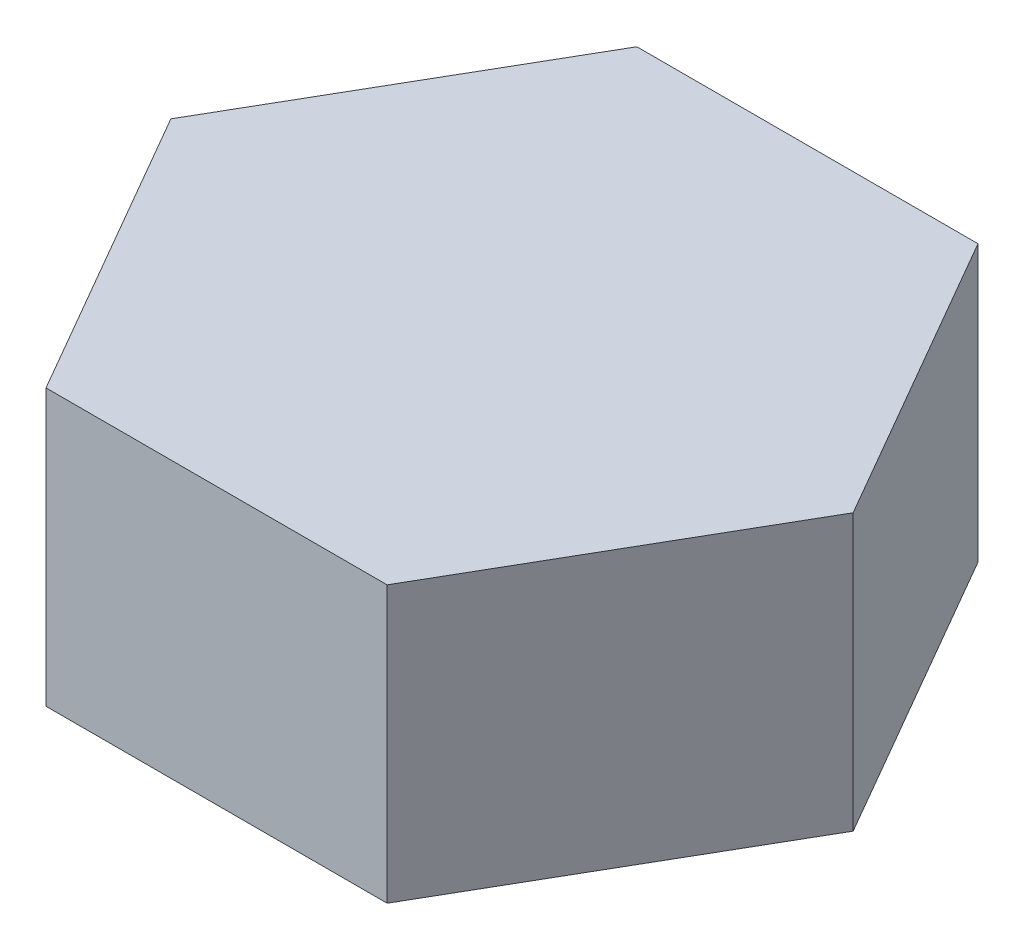
ISO-10303-21;
HEADER;
FILE_DESCRIPTION(('STEP AP214'),'2;1');
FILE_NAME('part.step','',(''),(''),'','','');
FILE_SCHEMA(('AUTOMOTIVE_DESIGN { 1 0 10303 214 1 1 1 1 }'));
ENDSEC;
DATA;
#1=APPLICATION_CONTEXT('core data for automotive mechanical design processes');
#2=APPLICATION_PROTOCOL_DEFINITION('international standard','automotive_design',2000,#1);
#3=PRODUCT_CONTEXT('',#1,'mechanical');
#4=PRODUCT('Part','Part','',(#3));
#5=PRODUCT_RELATED_PRODUCT_CATEGORY('part','',(#4));
#6=PRODUCT_DEFINITION_FORMATION('','',#4);
#7=PRODUCT_DEFINITION_CONTEXT('part definition',#1,'design');
#8=PRODUCT_DEFINITION('design','',#6,#7);
#9=PRODUCT_DEFINITION_SHAPE('','',#8);
#10=(LENGTH_UNIT() NAMED_UNIT(*) SI_UNIT(.MILLI.,.METRE.));
#11=(NAMED_UNIT(*) PLANE_ANGLE_UNIT() SI_UNIT($,.RADIAN.));
#12=(NAMED_UNIT(*) SI_UNIT($,.STERADIAN.) SOLID_ANGLE_UNIT());
#13=UNCERTAINTY_MEASURE_WITH_UNIT(LENGTH_MEASURE(1.E-05),#10,'distance_accuracy_value','');
#14=(GEOMETRIC_REPRESENTATION_CONTEXT(3) GLOBAL_UNCERTAINTY_ASSIGNED_CONTEXT((#13)) GLOBAL_UNIT_ASSIGNED_CONTEXT((#10,
#11,#12)) REPRESENTATION_CONTEXT('',''));
#15=CARTESIAN_POINT('',(0.,0.,0.));
#16=DIRECTION('',(0.,0.,1.));
#17=DIRECTION('',(1.,0.,0.));
#18=AXIS2_PLACEMENT_3D('',#15,#16,#17);
#19=CARTESIAN_POINT('',(1.299038105,2.1,2.24999999882799));
#20=DIRECTION('',(-0.866025403784439,0.,-0.5));
#21=DIRECTION('',(-0.5,0.,0.866025403784439));
#22=AXIS2_PLACEMENT_3D('',#19,#20,#21);
#23=PLANE('',#22);
#24=DIRECTION('',(0.5,0.,-0.866025403784439));
#25=VECTOR('',#24,1.);
#26=CARTESIAN_POINT('',(1.299038105,0.,2.24999999882799));
#27=LINE('',#26,#25);
#28=CARTESIAN_POINT('',(1.299038105,0.,2.24999999882799));
#29=VERTEX_POINT('',#28);
#30=CARTESIAN_POINT('',(2.59807621,0.,0.));
#31=VERTEX_POINT('',#30);
#32=EDGE_CURVE('E122',#29,#31,#27,.T.);
#33=ORIENTED_EDGE('',*,*,#32,.T.);
#34=DIRECTION('',(0.,-1.,0.));
#35=VECTOR('',#34,1.);
#36=CARTESIAN_POINT('',(2.59807621,2.1,0.));
#37=LINE('',#36,#35);
#38=CARTESIAN_POINT('',(2.59807621,2.1,0.));
#39=VERTEX_POINT('',#38);
#40=EDGE_CURVE('E11',#39,#31,#37,.T.);
#41=ORIENTED_EDGE('',*,*,#40,.F.);
#42=DIRECTION('',(0.5,0.,-0.866025403784439));
#43=VECTOR('',#42,1.);
#44=CARTESIAN_POINT('',(1.299038105,2.1,2.24999999882799));
#45=LINE('',#44,#43);
#46=CARTESIAN_POINT('',(1.299038105,2.1,2.24999999882799));
#47=VERTEX_POINT('',#46);
#48=EDGE_CURVE('E132',#47,#39,#45,.T.);
#49=ORIENTED_EDGE('',*,*,#48,.F.);
#50=DIRECTION('',(0.,-1.,0.));
#51=VECTOR('',#50,1.);
#52=CARTESIAN_POINT('',(1.299038105,2.1,2.24999999882799));
#53=LINE('',#52,#51);
#54=EDGE_CURVE('E118',#47,#29,#53,.T.);
#55=ORIENTED_EDGE('',*,*,#54,.T.);
#56=EDGE_LOOP('',(#33,#41,#49,#55));
#57=FACE_BOUND('',#56,.T.);
#58=ADVANCED_FACE('F38',(#57),#23,.F.);
#59=CARTESIAN_POINT('',(2.59807621,2.1,0.));
#60=DIRECTION('',(-0.866025403784439,0.,0.5));
#61=DIRECTION('',(0.5,0.,0.866025403784439));
#62=AXIS2_PLACEMENT_3D('',#59,#60,#61);
#63=PLANE('',#62);
#64=DIRECTION('',(-0.5,0.,-0.866025403784438));
#65=VECTOR('',#64,1.);
#66=CARTESIAN_POINT('',(2.59807621,0.,0.));
#67=LINE('',#66,#65);
#68=CARTESIAN_POINT('',(1.299038105,0.,-2.24999999882799));
#69=VERTEX_POINT('',#68);
#70=EDGE_CURVE('E125',#31,#69,#67,.T.);
#71=ORIENTED_EDGE('',*,*,#70,.T.);
#72=DIRECTION('',(0.,-1.,0.));
#73=VECTOR('',#72,1.);
#74=CARTESIAN_POINT('',(1.299038105,2.1,-2.24999999882799));
#75=LINE('',#74,#73);
#76=CARTESIAN_POINT('',(1.299038105,2.1,-2.24999999882799));
#77=VERTEX_POINT('',#76);
#78=EDGE_CURVE('E46',#77,#69,#75,.T.);
#79=ORIENTED_EDGE('',*,*,#78,.F.);
#80=DIRECTION('',(-0.5,0.,-0.866025403784438));
#81=VECTOR('',#80,1.);
#82=CARTESIAN_POINT('',(2.59807621,2.1,0.));
#83=LINE('',#82,#81);
#84=EDGE_CURVE('E91',#39,#77,#83,.T.);
#85=ORIENTED_EDGE('',*,*,#84,.F.);
#86=ORIENTED_EDGE('',*,*,#40,.T.);
#87=EDGE_LOOP('',(#71,#79,#85,#86));
#88=FACE_BOUND('',#87,.T.);
#89=ADVANCED_FACE('F156',(#88),#63,.F.);
#90=CARTESIAN_POINT('',(1.299038105,2.1,-2.24999999882799));
#91=DIRECTION('',(0.,0.,1.));
#92=DIRECTION('',(1.,0.,0.));
#93=AXIS2_PLACEMENT_3D('',#90,#91,#92);
#94=PLANE('',#93);
#95=DIRECTION('',(-1.,0.,0.));
#96=VECTOR('',#95,1.);
#97=CARTESIAN_POINT('',(1.299038105,0.,-2.24999999882799));
#98=LINE('',#97,#96);
#99=CARTESIAN_POINT('',(-1.299038105,0.,-2.24999999882799));
#100=VERTEX_POINT('',#99);
#101=EDGE_CURVE('E127',#69,#100,#98,.T.);
#102=ORIENTED_EDGE('',*,*,#101,.T.);
#103=DIRECTION('',(0.,-1.,0.));
#104=VECTOR('',#103,1.);
#105=CARTESIAN_POINT('',(-1.299038105,2.1,-2.24999999882799));
#106=LINE('',#105,#104);
#107=CARTESIAN_POINT('',(-1.299038105,2.1,-2.24999999882799));
#108=VERTEX_POINT('',#107);
#109=EDGE_CURVE('E113',#108,#100,#106,.T.);
#110=ORIENTED_EDGE('',*,*,#109,.F.);
#111=DIRECTION('',(-1.,0.,0.));
#112=VECTOR('',#111,1.);
#113=CARTESIAN_POINT('',(1.299038105,2.1,-2.24999999882799));
#114=LINE('',#113,#112);
#115=EDGE_CURVE('E104',#77,#108,#114,.T.);
#116=ORIENTED_EDGE('',*,*,#115,.F.);
#117=ORIENTED_EDGE('',*,*,#78,.T.);
#118=EDGE_LOOP('',(#102,#110,#116,#117));
#119=FACE_BOUND('',#118,.T.);
#120=ADVANCED_FACE('F138',(#119),#94,.F.);
#121=CARTESIAN_POINT('',(-1.299038105,2.1,-2.24999999882799));
#122=DIRECTION('',(0.866025403784439,0.,0.5));
#123=DIRECTION('',(0.5,0.,-0.866025403784439));
#124=AXIS2_PLACEMENT_3D('',#121,#122,#123);
#125=PLANE('',#124);
#126=DIRECTION('',(-0.5,0.,0.866025403784439));
#127=VECTOR('',#126,1.);
#128=CARTESIAN_POINT('',(-1.299038105,0.,-2.24999999882799));
#129=LINE('',#128,#127);
#130=CARTESIAN_POINT('',(-2.59807621,0.,0.));
#131=VERTEX_POINT('',#130);
#132=EDGE_CURVE('E112',#100,#131,#129,.T.);
#133=ORIENTED_EDGE('',*,*,#132,.T.);
#134=DIRECTION('',(0.,-1.,0.));
#135=VECTOR('',#134,1.);
#136=CARTESIAN_POINT('',(-2.59807621,2.1,0.));
#137=LINE('',#136,#135);
#138=CARTESIAN_POINT('',(-2.59807621,2.1,0.));
#139=VERTEX_POINT('',#138);
#140=EDGE_CURVE('E109',#139,#131,#137,.T.);
#141=ORIENTED_EDGE('',*,*,#140,.F.);
#142=DIRECTION('',(-0.5,0.,0.866025403784439));
#143=VECTOR('',#142,1.);
#144=CARTESIAN_POINT('',(-1.299038105,2.1,-2.24999999882799));
#145=LINE('',#144,#143);
#146=EDGE_CURVE('E98',#108,#139,#145,.T.);
#147=ORIENTED_EDGE('',*,*,#146,.F.);
#148=ORIENTED_EDGE('',*,*,#109,.T.);
#149=EDGE_LOOP('',(#133,#141,#147,#148));
#150=FACE_BOUND('',#149,.T.);
#151=ADVANCED_FACE('F110',(#150),#125,.F.);
#152=CARTESIAN_POINT('',(-2.59807621,2.1,0.));
#153=DIRECTION('',(0.866025403784438,0.,-0.5));
#154=DIRECTION('',(-0.5,0.,-0.866025403784439));
#155=AXIS2_PLACEMENT_3D('',#152,#153,#154);
#156=PLANE('',#155);
#157=DIRECTION('',(0.5,0.,0.866025403784438));
#158=VECTOR('',#157,1.);
#159=CARTESIAN_POINT('',(-2.59807621,0.,0.));
#160=LINE('',#159,#158);
#161=CARTESIAN_POINT('',(-1.299038105,0.,2.24999999882799));
#162=VERTEX_POINT('',#161);
#163=EDGE_CURVE('E77',#131,#162,#160,.T.);
#164=ORIENTED_EDGE('',*,*,#163,.T.);
#165=DIRECTION('',(0.,-1.,0.));
#166=VECTOR('',#165,1.);
#167=CARTESIAN_POINT('',(-1.299038105,2.1,2.24999999882799));
#168=LINE('',#167,#166);
#169=CARTESIAN_POINT('',(-1.299038105,2.1,2.24999999882799));
#170=VERTEX_POINT('',#169);
#171=EDGE_CURVE('E114',#170,#162,#168,.T.);
#172=ORIENTED_EDGE('',*,*,#171,.F.);
#173=DIRECTION('',(0.5,0.,0.866025403784438));
#174=VECTOR('',#173,1.);
#175=CARTESIAN_POINT('',(-2.59807621,2.1,0.));
#176=LINE('',#175,#174);
#177=EDGE_CURVE('E102',#139,#170,#176,.T.);
#178=ORIENTED_EDGE('',*,*,#177,.F.);
#179=ORIENTED_EDGE('',*,*,#140,.T.);
#180=EDGE_LOOP('',(#164,#172,#178,#179));
#181=FACE_BOUND('',#180,.T.);
#182=ADVANCED_FACE('F116',(#181),#156,.F.);
#183=CARTESIAN_POINT('',(-1.299038105,2.1,2.24999999882799));
#184=DIRECTION('',(0.,0.,-1.));
#185=DIRECTION('',(-1.,0.,0.));
#186=AXIS2_PLACEMENT_3D('',#183,#184,#185);
#187=PLANE('',#186);
#188=DIRECTION('',(1.,0.,0.));
#189=VECTOR('',#188,1.);
#190=CARTESIAN_POINT('',(-1.299038105,0.,2.24999999882799));
#191=LINE('',#190,#189);
#192=EDGE_CURVE('E83',#162,#29,#191,.T.);
#193=ORIENTED_EDGE('',*,*,#192,.T.);
#194=ORIENTED_EDGE('',*,*,#54,.F.);
#195=DIRECTION('',(1.,0.,0.));
#196=VECTOR('',#195,1.);
#197=CARTESIAN_POINT('',(-1.299038105,2.1,2.24999999882799));
#198=LINE('',#197,#196);
#199=EDGE_CURVE('E54',#170,#47,#198,.T.);
#200=ORIENTED_EDGE('',*,*,#199,.F.);
#201=ORIENTED_EDGE('',*,*,#171,.T.);
#202=EDGE_LOOP('',(#193,#194,#200,#201));
#203=FACE_BOUND('',#202,.T.);
#204=ADVANCED_FACE('F145',(#203),#187,.F.);
#205=CARTESIAN_POINT('',(0.,2.1,0.));
#206=DIRECTION('',(0.,1.,0.));
#207=DIRECTION('',(0.,0.,1.));
#208=AXIS2_PLACEMENT_3D('',#205,#206,#207);
#209=PLANE('',#208);
#210=ORIENTED_EDGE('',*,*,#48,.T.);
#211=ORIENTED_EDGE('',*,*,#84,.T.);
#212=ORIENTED_EDGE('',*,*,#115,.T.);
#213=ORIENTED_EDGE('',*,*,#146,.T.);
#214=ORIENTED_EDGE('',*,*,#177,.T.);
#215=ORIENTED_EDGE('',*,*,#199,.T.);
#216=EDGE_LOOP('',(#210,#211,#212,#213,#214,#215));
#217=FACE_BOUND('',#216,.T.);
#218=ADVANCED_FACE('F100',(#217),#209,.T.);
#219=CARTESIAN_POINT('',(0.,0.,0.));
#220=DIRECTION('',(0.,1.,0.));
#221=DIRECTION('',(0.,0.,1.));
#222=AXIS2_PLACEMENT_3D('',#219,#220,#221);
#223=PLANE('',#222);
#224=ORIENTED_EDGE('',*,*,#32,.F.);
#225=ORIENTED_EDGE('',*,*,#192,.F.);
#226=ORIENTED_EDGE('',*,*,#163,.F.);
#227=ORIENTED_EDGE('',*,*,#132,.F.);
#228=ORIENTED_EDGE('',*,*,#101,.F.);
#229=ORIENTED_EDGE('',*,*,#70,.F.);
#230=EDGE_LOOP('',(#224,#225,#226,#227,#228,#229));
#231=FACE_BOUND('',#230,.T.);
#232=ADVANCED_FACE('F141',(#231),#223,.F.);
#233=CLOSED_SHELL('',(#58,#89,#120,#151,#182,#204,#218,#232));
#234=MANIFOLD_SOLID_BREP('B2',#233);
#235=ADVANCED_BREP_SHAPE_REPRESENTATION('',(#18,#234),#14);
#236=SHAPE_DEFINITION_REPRESENTATION(#9,#235);
ENDSEC;
END-ISO-10303-21;
